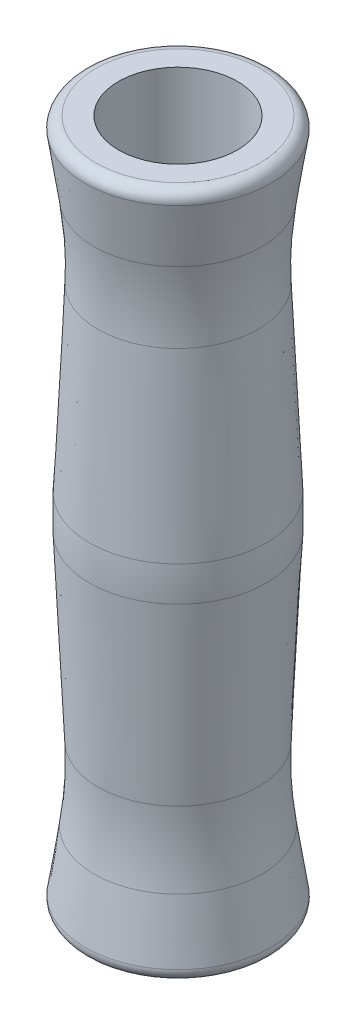
ISO-10303-21;
HEADER;
FILE_DESCRIPTION(('STEP AP214'),'2;1');
FILE_NAME('part.step','',(''),(''),'','','');
FILE_SCHEMA(('AUTOMOTIVE_DESIGN { 1 0 10303 214 1 1 1 1 }'));
ENDSEC;
DATA;
#1=APPLICATION_CONTEXT('core data for automotive mechanical design processes');
#2=APPLICATION_PROTOCOL_DEFINITION('international standard','automotive_design',2000,#1);
#3=PRODUCT_CONTEXT('',#1,'mechanical');
#4=PRODUCT('Part','Part','',(#3));
#5=PRODUCT_RELATED_PRODUCT_CATEGORY('part','',(#4));
#6=PRODUCT_DEFINITION_FORMATION('','',#4);
#7=PRODUCT_DEFINITION_CONTEXT('part definition',#1,'design');
#8=PRODUCT_DEFINITION('design','',#6,#7);
#9=PRODUCT_DEFINITION_SHAPE('','',#8);
#10=(LENGTH_UNIT() NAMED_UNIT(*) SI_UNIT(.MILLI.,.METRE.));
#11=(NAMED_UNIT(*) PLANE_ANGLE_UNIT() SI_UNIT($,.RADIAN.));
#12=(NAMED_UNIT(*) SI_UNIT($,.STERADIAN.) SOLID_ANGLE_UNIT());
#13=UNCERTAINTY_MEASURE_WITH_UNIT(LENGTH_MEASURE(1.E-05),#10,'distance_accuracy_value','');
#14=(GEOMETRIC_REPRESENTATION_CONTEXT(3) GLOBAL_UNCERTAINTY_ASSIGNED_CONTEXT((#13)) GLOBAL_UNIT_ASSIGNED_CONTEXT((#10,
#11,#12)) REPRESENTATION_CONTEXT('',''));
#15=CARTESIAN_POINT('',(0.,0.,0.));
#16=DIRECTION('',(0.,0.,1.));
#17=DIRECTION('',(1.,0.,0.));
#18=AXIS2_PLACEMENT_3D('',#15,#16,#17);
#19=CARTESIAN_POINT('',(0.,-127.,0.));
#20=DIRECTION('',(0.,1.,0.));
#21=DIRECTION('',(0.,0.,1.));
#22=AXIS2_PLACEMENT_3D('',#19,#20,#21);
#23=PLANE('',#22);
#24=CARTESIAN_POINT('',(0.,-127.,0.));
#25=DIRECTION('',(0.,1.,0.));
#26=DIRECTION('',(0.,0.,1.));
#27=AXIS2_PLACEMENT_3D('',#24,#25,#26);
#28=CIRCLE('',#27,11.);
#29=CARTESIAN_POINT('',(0.,-127.,11.));
#30=VERTEX_POINT('',#29);
#31=EDGE_CURVE('E72',#30,#30,#28,.T.);
#32=ORIENTED_EDGE('',*,*,#31,.T.);
#33=EDGE_LOOP('',(#32));
#34=FACE_BOUND('',#33,.T.);
#35=CARTESIAN_POINT('',(0.,-127.,0.));
#36=DIRECTION('',(0.,1.,0.));
#37=DIRECTION('',(0.,0.,1.));
#38=AXIS2_PLACEMENT_3D('',#35,#36,#37);
#39=CIRCLE('',#38,15.1776251583843);
#40=CARTESIAN_POINT('',(0.,-127.,15.1776251583843));
#41=VERTEX_POINT('',#40);
#42=EDGE_CURVE('E66',#41,#41,#39,.F.);
#43=ORIENTED_EDGE('',*,*,#42,.T.);
#44=EDGE_LOOP('',(#43));
#45=FACE_BOUND('',#44,.T.);
#46=ADVANCED_FACE('F34',(#34,#45),#23,.F.);
#47=CARTESIAN_POINT('',(0.,-127.,0.));
#48=DIRECTION('',(0.,-1.,0.));
#49=DIRECTION('',(0.,0.,-1.));
#50=AXIS2_PLACEMENT_3D('',#47,#48,#49);
#51=CONICAL_SURFACE('',#50,17.5,0.148889947609497);
#52=CARTESIAN_POINT('',(0.,-113.765180140609,0.));
#53=DIRECTION('',(0.,-1.,0.));
#54=DIRECTION('',(0.,0.,-1.));
#55=AXIS2_PLACEMENT_3D('',#52,#53,#54);
#56=CIRCLE('',#55,15.5147770210913);
#57=CARTESIAN_POINT('',(0.,-113.765180140609,-15.5147770210913));
#58=VERTEX_POINT('',#57);
#59=EDGE_CURVE('E49',#58,#58,#56,.T.);
#60=ORIENTED_EDGE('',*,*,#59,.T.);
#61=EDGE_LOOP('',(#60));
#62=FACE_BOUND('',#61,.T.);
#63=CARTESIAN_POINT('',(0.,-124.70331909414,0.));
#64=DIRECTION('',(0.,1.,0.));
#65=DIRECTION('',(0.,0.,1.));
#66=AXIS2_PLACEMENT_3D('',#63,#64,#65);
#67=CIRCLE('',#66,17.1554978641209);
#68=CARTESIAN_POINT('',(0.,-124.70331909414,17.1554978641209));
#69=VERTEX_POINT('',#68);
#70=EDGE_CURVE('E69',#69,#69,#67,.T.);
#71=ORIENTED_EDGE('',*,*,#70,.T.);
#72=EDGE_LOOP('',(#71));
#73=FACE_BOUND('',#72,.T.);
#74=ADVANCED_FACE('F111',(#62,#73),#51,.T.);
#75=CARTESIAN_POINT('',(0.,-107.,0.));
#76=DIRECTION('',(0.,1.,0.));
#77=DIRECTION('',(0.,0.,1.));
#78=AXIS2_PLACEMENT_3D('',#75,#76,#77);
#79=CONICAL_SURFACE('',#78,14.5,0.0459446558081198);
#80=CARTESIAN_POINT('',(0.,-100.16635390231,0.));
#81=DIRECTION('',(0.,1.,0.));
#82=DIRECTION('',(0.,0.,1.));
#83=AXIS2_PLACEMENT_3D('',#80,#81,#82);
#84=CIRCLE('',#83,14.8141906251811);
#85=CARTESIAN_POINT('',(0.,-100.16635390231,14.8141906251811));
#86=VERTEX_POINT('',#85);
#87=EDGE_CURVE('E54',#86,#86,#84,.T.);
#88=ORIENTED_EDGE('',*,*,#87,.T.);
#89=EDGE_LOOP('',(#88));
#90=FACE_BOUND('',#89,.T.);
#91=CARTESIAN_POINT('',(0.,-66.7149945331812,0.));
#92=DIRECTION('',(0.,-1.,0.));
#93=DIRECTION('',(0.,0.,-1.));
#94=AXIS2_PLACEMENT_3D('',#91,#92,#93);
#95=CIRCLE('',#94,16.352184159394);
#96=CARTESIAN_POINT('',(0.,-66.7149945331812,-16.352184159394));
#97=VERTEX_POINT('',#96);
#98=EDGE_CURVE('E57',#97,#97,#95,.T.);
#99=ORIENTED_EDGE('',*,*,#98,.T.);
#100=EDGE_LOOP('',(#99));
#101=FACE_BOUND('',#100,.T.);
#102=ADVANCED_FACE('F116',(#90,#101),#79,.T.);
#103=CARTESIAN_POINT('',(0.,-63.5,0.));
#104=DIRECTION('',(0.,-1.,0.));
#105=DIRECTION('',(0.,0.,-1.));
#106=AXIS2_PLACEMENT_3D('',#103,#104,#105);
#107=CONICAL_SURFACE('',#106,16.5,0.0459446558081198);
#108=CARTESIAN_POINT('',(0.,-26.8336460976897,0.));
#109=DIRECTION('',(0.,-1.,0.));
#110=DIRECTION('',(0.,0.,-1.));
#111=AXIS2_PLACEMENT_3D('',#108,#109,#110);
#112=CIRCLE('',#111,14.8141906251811);
#113=CARTESIAN_POINT('',(0.,-26.8336460976897,-14.8141906251811));
#114=VERTEX_POINT('',#113);
#115=EDGE_CURVE('E10',#114,#114,#112,.T.);
#116=ORIENTED_EDGE('',*,*,#115,.T.);
#117=EDGE_LOOP('',(#116));
#118=FACE_BOUND('',#117,.T.);
#119=CARTESIAN_POINT('',(0.,-60.2850054668188,0.));
#120=DIRECTION('',(0.,1.,0.));
#121=DIRECTION('',(0.,0.,1.));
#122=AXIS2_PLACEMENT_3D('',#119,#120,#121);
#123=CIRCLE('',#122,16.352184159394);
#124=CARTESIAN_POINT('',(0.,-60.2850054668188,16.352184159394));
#125=VERTEX_POINT('',#124);
#126=EDGE_CURVE('E41',#125,#125,#123,.T.);
#127=ORIENTED_EDGE('',*,*,#126,.T.);
#128=EDGE_LOOP('',(#127));
#129=FACE_BOUND('',#128,.T.);
#130=ADVANCED_FACE('F122',(#118,#129),#107,.T.);
#131=CARTESIAN_POINT('',(0.,-20.,0.));
#132=DIRECTION('',(0.,1.,0.));
#133=DIRECTION('',(0.,0.,1.));
#134=AXIS2_PLACEMENT_3D('',#131,#132,#133);
#135=CONICAL_SURFACE('',#134,14.5,0.148889947609497);
#136=CARTESIAN_POINT('',(0.,-13.2348198593914,0.));
#137=DIRECTION('',(0.,1.,0.));
#138=DIRECTION('',(0.,0.,1.));
#139=AXIS2_PLACEMENT_3D('',#136,#137,#138);
#140=CIRCLE('',#139,15.5147770210913);
#141=CARTESIAN_POINT('',(0.,-13.2348198593914,15.5147770210913));
#142=VERTEX_POINT('',#141);
#143=EDGE_CURVE('E45',#142,#142,#140,.T.);
#144=ORIENTED_EDGE('',*,*,#143,.T.);
#145=EDGE_LOOP('',(#144));
#146=FACE_BOUND('',#145,.T.);
#147=CARTESIAN_POINT('',(0.,-2.29668090586048,0.));
#148=DIRECTION('',(0.,-1.,0.));
#149=DIRECTION('',(0.,0.,-1.));
#150=AXIS2_PLACEMENT_3D('',#147,#148,#149);
#151=CIRCLE('',#150,17.1554978641209);
#152=CARTESIAN_POINT('',(0.,-2.29668090586048,-17.1554978641209));
#153=VERTEX_POINT('',#152);
#154=EDGE_CURVE('E60',#153,#153,#151,.T.);
#155=ORIENTED_EDGE('',*,*,#154,.T.);
#156=EDGE_LOOP('',(#155));
#157=FACE_BOUND('',#156,.T.);
#158=ADVANCED_FACE('F91',(#146,#157),#135,.T.);
#159=CARTESIAN_POINT('',(0.,0.,0.));
#160=DIRECTION('',(0.,-1.,0.));
#161=DIRECTION('',(0.,0.,-1.));
#162=AXIS2_PLACEMENT_3D('',#159,#160,#161);
#163=PLANE('',#162);
#164=CARTESIAN_POINT('',(0.,0.,0.));
#165=DIRECTION('',(0.,1.,0.));
#166=DIRECTION('',(0.,0.,1.));
#167=AXIS2_PLACEMENT_3D('',#164,#165,#166);
#168=CIRCLE('',#167,11.);
#169=CARTESIAN_POINT('',(0.,0.,11.));
#170=VERTEX_POINT('',#169);
#171=EDGE_CURVE('E73',#170,#170,#168,.T.);
#172=ORIENTED_EDGE('',*,*,#171,.F.);
#173=EDGE_LOOP('',(#172));
#174=FACE_BOUND('',#173,.T.);
#175=CARTESIAN_POINT('',(0.,0.,0.));
#176=DIRECTION('',(0.,-1.,0.));
#177=DIRECTION('',(0.,0.,-1.));
#178=AXIS2_PLACEMENT_3D('',#175,#176,#177);
#179=CIRCLE('',#178,15.1776251583843);
#180=CARTESIAN_POINT('',(0.,0.,-15.1776251583843));
#181=VERTEX_POINT('',#180);
#182=EDGE_CURVE('E63',#181,#181,#179,.F.);
#183=ORIENTED_EDGE('',*,*,#182,.T.);
#184=EDGE_LOOP('',(#183));
#185=FACE_BOUND('',#184,.T.);
#186=ADVANCED_FACE('F87',(#174,#185),#163,.F.);
#187=CARTESIAN_POINT('',(0.,-125.,0.));
#188=DIRECTION('',(0.,1.,0.));
#189=DIRECTION('',(0.,0.,1.));
#190=AXIS2_PLACEMENT_3D('',#187,#188,#189);
#191=TOROIDAL_SURFACE('',#190,15.1776251583843,2.);
#192=ORIENTED_EDGE('',*,*,#42,.F.);
#193=EDGE_LOOP('',(#192));
#194=FACE_BOUND('',#193,.T.);
#195=ORIENTED_EDGE('',*,*,#70,.F.);
#196=EDGE_LOOP('',(#195));
#197=FACE_BOUND('',#196,.T.);
#198=ADVANCED_FACE('F90',(#194,#197),#191,.T.);
#199=CARTESIAN_POINT('',(0.,-2.,0.));
#200=DIRECTION('',(0.,-1.,0.));
#201=DIRECTION('',(0.,0.,-1.));
#202=AXIS2_PLACEMENT_3D('',#199,#200,#201);
#203=TOROIDAL_SURFACE('',#202,15.1776251583843,2.);
#204=ORIENTED_EDGE('',*,*,#154,.F.);
#205=EDGE_LOOP('',(#204));
#206=FACE_BOUND('',#205,.T.);
#207=ORIENTED_EDGE('',*,*,#182,.F.);
#208=EDGE_LOOP('',(#207));
#209=FACE_BOUND('',#208,.T.);
#210=ADVANCED_FACE('F95',(#206,#209),#203,.T.);
#211=CARTESIAN_POINT('',(0.,-103.381348435491,0.));
#212=DIRECTION('',(0.,1.,0.));
#213=DIRECTION('',(0.,0.,1.));
#214=AXIS2_PLACEMENT_3D('',#211,#212,#213);
#215=TOROIDAL_SURFACE('',#214,84.7403217218721,70.);
#216=ORIENTED_EDGE('',*,*,#59,.F.);
#217=EDGE_LOOP('',(#216));
#218=FACE_BOUND('',#217,.T.);
#219=ORIENTED_EDGE('',*,*,#87,.F.);
#220=EDGE_LOOP('',(#219));
#221=FACE_BOUND('',#220,.T.);
#222=ADVANCED_FACE('F97',(#218,#221),#215,.F.);
#223=CARTESIAN_POINT('',(0.,-23.6186515645085,0.));
#224=DIRECTION('',(0.,1.,0.));
#225=DIRECTION('',(0.,0.,1.));
#226=AXIS2_PLACEMENT_3D('',#223,#224,#225);
#227=TOROIDAL_SURFACE('',#226,84.7403217218721,70.);
#228=ORIENTED_EDGE('',*,*,#115,.F.);
#229=EDGE_LOOP('',(#228));
#230=FACE_BOUND('',#229,.T.);
#231=ORIENTED_EDGE('',*,*,#143,.F.);
#232=EDGE_LOOP('',(#231));
#233=FACE_BOUND('',#232,.T.);
#234=ADVANCED_FACE('F104',(#230,#233),#227,.F.);
#235=CARTESIAN_POINT('',(0.,-63.5,0.));
#236=DIRECTION('',(0.,-1.,0.));
#237=DIRECTION('',(0.,0.,-1.));
#238=AXIS2_PLACEMENT_3D('',#235,#236,#237);
#239=DEGENERATE_TOROIDAL_SURFACE('',#238,53.573946937297,70.,.F.);
#240=ORIENTED_EDGE('',*,*,#98,.F.);
#241=EDGE_LOOP('',(#240));
#242=FACE_BOUND('',#241,.T.);
#243=ORIENTED_EDGE('',*,*,#126,.F.);
#244=EDGE_LOOP('',(#243));
#245=FACE_BOUND('',#244,.T.);
#246=ADVANCED_FACE('F36',(#242,#245),#239,.F.);
#247=CARTESIAN_POINT('',(0.,-127.,0.));
#248=DIRECTION('',(0.,1.,0.));
#249=DIRECTION('',(0.,0.,1.));
#250=AXIS2_PLACEMENT_3D('',#247,#248,#249);
#251=CYLINDRICAL_SURFACE('',#250,11.);
#252=ORIENTED_EDGE('',*,*,#31,.F.);
#253=EDGE_LOOP('',(#252));
#254=FACE_BOUND('',#253,.T.);
#255=ORIENTED_EDGE('',*,*,#171,.T.);
#256=EDGE_LOOP('',(#255));
#257=FACE_BOUND('',#256,.T.);
#258=ADVANCED_FACE('F81',(#254,#257),#251,.F.);
#259=CLOSED_SHELL('',(#46,#74,#102,#130,#158,#186,#198,#210,#222,#234,#246,#258));
#260=MANIFOLD_SOLID_BREP('B2',#259);
#261=ADVANCED_BREP_SHAPE_REPRESENTATION('',(#18,#260),#14);
#262=SHAPE_DEFINITION_REPRESENTATION(#9,#261);
ENDSEC;
END-ISO-10303-21;
